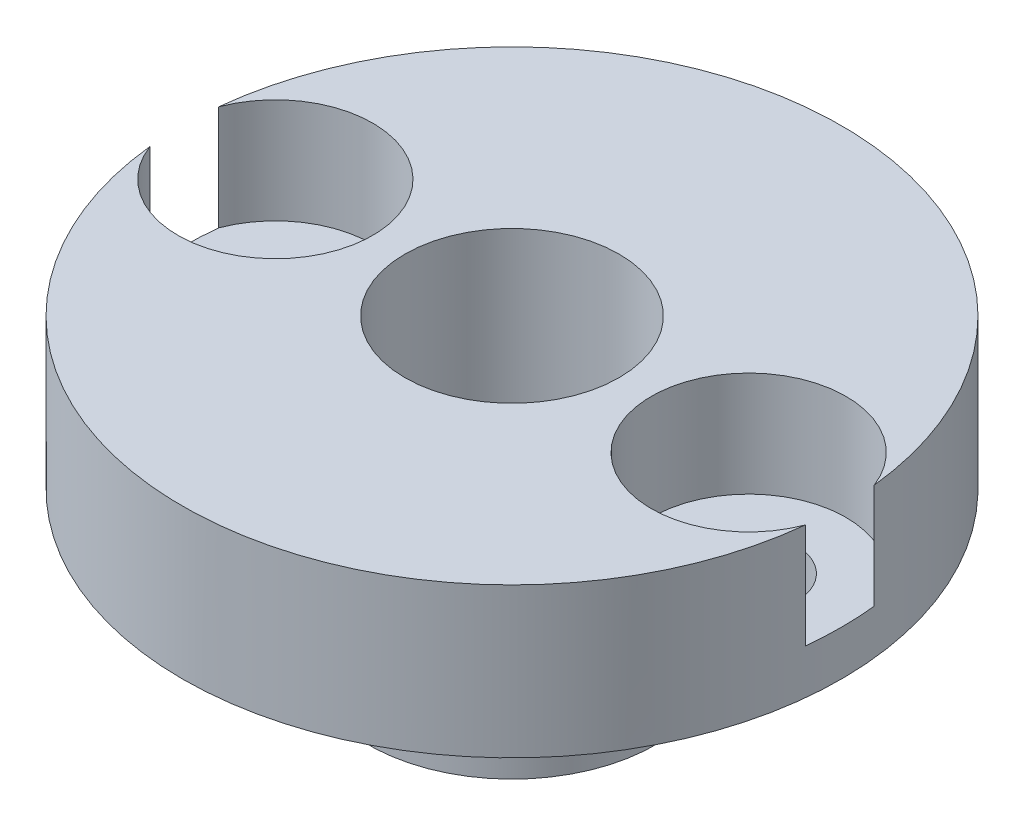
ISO-10303-21;
HEADER;
FILE_DESCRIPTION(('STEP AP214'),'2;1');
FILE_NAME('part.step','',(''),(''),'','','');
FILE_SCHEMA(('AUTOMOTIVE_DESIGN { 1 0 10303 214 1 1 1 1 }'));
ENDSEC;
DATA;
#1=APPLICATION_CONTEXT('core data for automotive mechanical design processes');
#2=APPLICATION_PROTOCOL_DEFINITION('international standard','automotive_design',2000,#1);
#3=PRODUCT_CONTEXT('',#1,'mechanical');
#4=PRODUCT('Part','Part','',(#3));
#5=PRODUCT_RELATED_PRODUCT_CATEGORY('part','',(#4));
#6=PRODUCT_DEFINITION_FORMATION('','',#4);
#7=PRODUCT_DEFINITION_CONTEXT('part definition',#1,'design');
#8=PRODUCT_DEFINITION('design','',#6,#7);
#9=PRODUCT_DEFINITION_SHAPE('','',#8);
#10=(LENGTH_UNIT() NAMED_UNIT(*) SI_UNIT(.MILLI.,.METRE.));
#11=(NAMED_UNIT(*) PLANE_ANGLE_UNIT() SI_UNIT($,.RADIAN.));
#12=(NAMED_UNIT(*) SI_UNIT($,.STERADIAN.) SOLID_ANGLE_UNIT());
#13=UNCERTAINTY_MEASURE_WITH_UNIT(LENGTH_MEASURE(1.E-05),#10,'distance_accuracy_value','');
#14=(GEOMETRIC_REPRESENTATION_CONTEXT(3) GLOBAL_UNCERTAINTY_ASSIGNED_CONTEXT((#13)) GLOBAL_UNIT_ASSIGNED_CONTEXT((#10,
#11,#12)) REPRESENTATION_CONTEXT('',''));
#15=CARTESIAN_POINT('',(0.,0.,0.));
#16=DIRECTION('',(0.,0.,1.));
#17=DIRECTION('',(1.,0.,0.));
#18=AXIS2_PLACEMENT_3D('',#15,#16,#17);
#19=CARTESIAN_POINT('',(7.9,5.,0.));
#20=DIRECTION('',(0.,-1.,0.));
#21=DIRECTION('',(0.,0.,-1.));
#22=AXIS2_PLACEMENT_3D('',#19,#20,#21);
#23=CYLINDRICAL_SURFACE('',#22,1.6);
#24=CARTESIAN_POINT('',(7.9,0.,0.));
#25=DIRECTION('',(0.,-1.,0.));
#26=DIRECTION('',(0.,0.,-1.));
#27=AXIS2_PLACEMENT_3D('',#24,#25,#26);
#28=CIRCLE('',#27,1.6);
#29=CARTESIAN_POINT('',(7.9,0.,-1.6));
#30=VERTEX_POINT('',#29);
#31=EDGE_CURVE('E127',#30,#30,#28,.T.);
#32=ORIENTED_EDGE('',*,*,#31,.T.);
#33=EDGE_LOOP('',(#32));
#34=FACE_BOUND('',#33,.T.);
#35=CARTESIAN_POINT('',(7.9,1.5,0.));
#36=DIRECTION('',(0.,1.,0.));
#37=DIRECTION('',(0.,0.,1.));
#38=AXIS2_PLACEMENT_3D('',#35,#36,#37);
#39=CIRCLE('',#38,1.6);
#40=CARTESIAN_POINT('',(7.9,1.5,1.6));
#41=VERTEX_POINT('',#40);
#42=EDGE_CURVE('E39',#41,#41,#39,.F.);
#43=ORIENTED_EDGE('',*,*,#42,.F.);
#44=EDGE_LOOP('',(#43));
#45=FACE_BOUND('',#44,.T.);
#46=ADVANCED_FACE('F35',(#34,#45),#23,.F.);
#47=CARTESIAN_POINT('',(-7.9,5.,0.));
#48=DIRECTION('',(0.,-1.,0.));
#49=DIRECTION('',(0.,0.,-1.));
#50=AXIS2_PLACEMENT_3D('',#47,#48,#49);
#51=CYLINDRICAL_SURFACE('',#50,1.6);
#52=CARTESIAN_POINT('',(-7.9,0.,0.));
#53=DIRECTION('',(0.,-1.,0.));
#54=DIRECTION('',(0.,0.,-1.));
#55=AXIS2_PLACEMENT_3D('',#52,#53,#54);
#56=CIRCLE('',#55,1.6);
#57=CARTESIAN_POINT('',(-7.9,0.,-1.6));
#58=VERTEX_POINT('',#57);
#59=EDGE_CURVE('E130',#58,#58,#56,.T.);
#60=ORIENTED_EDGE('',*,*,#59,.T.);
#61=EDGE_LOOP('',(#60));
#62=FACE_BOUND('',#61,.T.);
#63=CARTESIAN_POINT('',(-7.9,1.5,0.));
#64=DIRECTION('',(0.,1.,0.));
#65=DIRECTION('',(0.,0.,1.));
#66=AXIS2_PLACEMENT_3D('',#63,#64,#65);
#67=CIRCLE('',#66,1.6);
#68=CARTESIAN_POINT('',(-7.9,1.5,1.6));
#69=VERTEX_POINT('',#68);
#70=EDGE_CURVE('E106',#69,#69,#67,.F.);
#71=ORIENTED_EDGE('',*,*,#70,.F.);
#72=EDGE_LOOP('',(#71));
#73=FACE_BOUND('',#72,.T.);
#74=ADVANCED_FACE('F151',(#62,#73),#51,.F.);
#75=CARTESIAN_POINT('',(0.,5.,0.));
#76=DIRECTION('',(0.,-1.,0.));
#77=DIRECTION('',(0.,0.,-1.));
#78=AXIS2_PLACEMENT_3D('',#75,#76,#77);
#79=CYLINDRICAL_SURFACE('',#78,11.);
#80=CARTESIAN_POINT('',(0.,1.5,0.));
#81=DIRECTION('',(0.,1.,0.));
#82=DIRECTION('',(0.,0.,1.));
#83=AXIS2_PLACEMENT_3D('',#80,#81,#82);
#84=CIRCLE('',#83,11.);
#85=CARTESIAN_POINT('',(-10.9397151898734,1.5,-1.15005720051344));
#86=VERTEX_POINT('',#85);
#87=CARTESIAN_POINT('',(-10.9397151898734,1.5,1.15005720051344));
#88=VERTEX_POINT('',#87);
#89=EDGE_CURVE('E93',#86,#88,#84,.T.);
#90=ORIENTED_EDGE('',*,*,#89,.F.);
#91=DIRECTION('',(0.,1.,0.));
#92=VECTOR('',#91,1.);
#93=CARTESIAN_POINT('',(-10.9397151898734,3.25,-1.15005720051343));
#94=LINE('',#93,#92);
#95=CARTESIAN_POINT('',(-10.9397151898734,5.,-1.15005720051343));
#96=VERTEX_POINT('',#95);
#97=EDGE_CURVE('E80',#86,#96,#94,.T.);
#98=ORIENTED_EDGE('',*,*,#97,.T.);
#99=CARTESIAN_POINT('',(0.,5.,0.));
#100=DIRECTION('',(0.,1.,0.));
#101=DIRECTION('',(0.,0.,1.));
#102=AXIS2_PLACEMENT_3D('',#99,#100,#101);
#103=CIRCLE('',#102,11.);
#104=CARTESIAN_POINT('',(10.9397151898734,5.,-1.15005720051343));
#105=VERTEX_POINT('',#104);
#106=EDGE_CURVE('E44',#105,#96,#103,.T.);
#107=ORIENTED_EDGE('',*,*,#106,.F.);
#108=DIRECTION('',(0.,1.,0.));
#109=VECTOR('',#108,1.);
#110=CARTESIAN_POINT('',(10.9397151898734,3.25,-1.15005720051343));
#111=LINE('',#110,#109);
#112=CARTESIAN_POINT('',(10.9397151898734,1.5,-1.15005720051344));
#113=VERTEX_POINT('',#112);
#114=EDGE_CURVE('E60',#105,#113,#111,.F.);
#115=ORIENTED_EDGE('',*,*,#114,.T.);
#116=CARTESIAN_POINT('',(0.,1.5,0.));
#117=DIRECTION('',(0.,1.,0.));
#118=DIRECTION('',(0.,0.,1.));
#119=AXIS2_PLACEMENT_3D('',#116,#117,#118);
#120=CIRCLE('',#119,11.);
#121=CARTESIAN_POINT('',(10.9397151898734,1.5,1.15005720051344));
#122=VERTEX_POINT('',#121);
#123=EDGE_CURVE('E117',#122,#113,#120,.T.);
#124=ORIENTED_EDGE('',*,*,#123,.F.);
#125=DIRECTION('',(0.,1.,0.));
#126=VECTOR('',#125,1.);
#127=CARTESIAN_POINT('',(10.9397151898734,3.25,1.15005720051343));
#128=LINE('',#127,#126);
#129=CARTESIAN_POINT('',(10.9397151898734,5.,1.15005720051343));
#130=VERTEX_POINT('',#129);
#131=EDGE_CURVE('E120',#122,#130,#128,.T.);
#132=ORIENTED_EDGE('',*,*,#131,.T.);
#133=CARTESIAN_POINT('',(-10.9397151898734,5.,1.15005720051343));
#134=VERTEX_POINT('',#133);
#135=EDGE_CURVE('E99',#134,#130,#103,.T.);
#136=ORIENTED_EDGE('',*,*,#135,.F.);
#137=DIRECTION('',(0.,1.,0.));
#138=VECTOR('',#137,1.);
#139=CARTESIAN_POINT('',(-10.9397151898734,3.25,1.15005720051343));
#140=LINE('',#139,#138);
#141=EDGE_CURVE('E52',#134,#88,#140,.F.);
#142=ORIENTED_EDGE('',*,*,#141,.T.);
#143=EDGE_LOOP('',(#90,#98,#107,#115,#124,#132,#136,#142));
#144=FACE_BOUND('',#143,.T.);
#145=CARTESIAN_POINT('',(0.,0.,0.));
#146=DIRECTION('',(0.,1.,0.));
#147=DIRECTION('',(0.,0.,1.));
#148=AXIS2_PLACEMENT_3D('',#145,#146,#147);
#149=CIRCLE('',#148,11.);
#150=CARTESIAN_POINT('',(0.,0.,11.));
#151=VERTEX_POINT('',#150);
#152=EDGE_CURVE('E101',#151,#151,#149,.T.);
#153=ORIENTED_EDGE('',*,*,#152,.T.);
#154=EDGE_LOOP('',(#153));
#155=FACE_BOUND('',#154,.T.);
#156=ADVANCED_FACE('F37',(#144,#155),#79,.T.);
#157=CARTESIAN_POINT('',(0.,5.,0.));
#158=DIRECTION('',(0.,1.,0.));
#159=DIRECTION('',(0.,0.,1.));
#160=AXIS2_PLACEMENT_3D('',#157,#158,#159);
#161=PLANE('',#160);
#162=CARTESIAN_POINT('',(-7.9,5.,0.));
#163=DIRECTION('',(0.,1.,0.));
#164=DIRECTION('',(0.,0.,1.));
#165=AXIS2_PLACEMENT_3D('',#162,#163,#164);
#166=CIRCLE('',#165,3.25);
#167=EDGE_CURVE('E77',#134,#96,#166,.T.);
#168=ORIENTED_EDGE('',*,*,#167,.F.);
#169=ORIENTED_EDGE('',*,*,#135,.T.);
#170=CARTESIAN_POINT('',(7.9,5.,0.));
#171=DIRECTION('',(0.,1.,0.));
#172=DIRECTION('',(0.,0.,1.));
#173=AXIS2_PLACEMENT_3D('',#170,#171,#172);
#174=CIRCLE('',#173,3.25);
#175=EDGE_CURVE('E98',#105,#130,#174,.T.);
#176=ORIENTED_EDGE('',*,*,#175,.F.);
#177=ORIENTED_EDGE('',*,*,#106,.T.);
#178=EDGE_LOOP('',(#168,#169,#176,#177));
#179=FACE_BOUND('',#178,.T.);
#180=CARTESIAN_POINT('',(0.,5.,0.));
#181=DIRECTION('',(0.,-1.,0.));
#182=DIRECTION('',(0.,0.,-1.));
#183=AXIS2_PLACEMENT_3D('',#180,#181,#182);
#184=CIRCLE('',#183,3.575);
#185=CARTESIAN_POINT('',(0.,5.,-3.575));
#186=VERTEX_POINT('',#185);
#187=EDGE_CURVE('E124',#186,#186,#184,.T.);
#188=ORIENTED_EDGE('',*,*,#187,.T.);
#189=EDGE_LOOP('',(#188));
#190=FACE_BOUND('',#189,.T.);
#191=ADVANCED_FACE('F96',(#179,#190),#161,.T.);
#192=CARTESIAN_POINT('',(0.,0.,0.));
#193=DIRECTION('',(0.,1.,0.));
#194=DIRECTION('',(0.,0.,1.));
#195=AXIS2_PLACEMENT_3D('',#192,#193,#194);
#196=PLANE('',#195);
#197=ORIENTED_EDGE('',*,*,#59,.F.);
#198=EDGE_LOOP('',(#197));
#199=FACE_BOUND('',#198,.T.);
#200=ORIENTED_EDGE('',*,*,#31,.F.);
#201=EDGE_LOOP('',(#200));
#202=FACE_BOUND('',#201,.T.);
#203=CARTESIAN_POINT('',(0.,0.,0.));
#204=DIRECTION('',(0.,-1.,0.));
#205=DIRECTION('',(0.,0.,-1.));
#206=AXIS2_PLACEMENT_3D('',#203,#204,#205);
#207=CIRCLE('',#206,4.8);
#208=CARTESIAN_POINT('',(0.,0.,-4.8));
#209=VERTEX_POINT('',#208);
#210=EDGE_CURVE('E11',#209,#209,#207,.T.);
#211=ORIENTED_EDGE('',*,*,#210,.F.);
#212=EDGE_LOOP('',(#211));
#213=FACE_BOUND('',#212,.T.);
#214=ORIENTED_EDGE('',*,*,#152,.F.);
#215=EDGE_LOOP('',(#214));
#216=FACE_BOUND('',#215,.T.);
#217=ADVANCED_FACE('F142',(#199,#202,#213,#216),#196,.F.);
#218=CARTESIAN_POINT('',(0.,-5.,0.));
#219=DIRECTION('',(0.,1.,0.));
#220=DIRECTION('',(0.,0.,1.));
#221=AXIS2_PLACEMENT_3D('',#218,#219,#220);
#222=CYLINDRICAL_SURFACE('',#221,4.8);
#223=CARTESIAN_POINT('',(0.,-5.,0.));
#224=DIRECTION('',(0.,-1.,0.));
#225=DIRECTION('',(0.,0.,-1.));
#226=AXIS2_PLACEMENT_3D('',#223,#224,#225);
#227=CIRCLE('',#226,4.8);
#228=CARTESIAN_POINT('',(0.,-5.,-4.8));
#229=VERTEX_POINT('',#228);
#230=EDGE_CURVE('E105',#229,#229,#227,.T.);
#231=ORIENTED_EDGE('',*,*,#230,.F.);
#232=EDGE_LOOP('',(#231));
#233=FACE_BOUND('',#232,.T.);
#234=ORIENTED_EDGE('',*,*,#210,.T.);
#235=EDGE_LOOP('',(#234));
#236=FACE_BOUND('',#235,.T.);
#237=ADVANCED_FACE('F139',(#233,#236),#222,.T.);
#238=CARTESIAN_POINT('',(0.,-5.,0.));
#239=DIRECTION('',(0.,-1.,0.));
#240=DIRECTION('',(0.,0.,-1.));
#241=AXIS2_PLACEMENT_3D('',#238,#239,#240);
#242=PLANE('',#241);
#243=CARTESIAN_POINT('',(0.,-5.,0.));
#244=DIRECTION('',(0.,-1.,0.));
#245=DIRECTION('',(0.,0.,-1.));
#246=AXIS2_PLACEMENT_3D('',#243,#244,#245);
#247=CIRCLE('',#246,3.575);
#248=CARTESIAN_POINT('',(0.,-5.,-3.575));
#249=VERTEX_POINT('',#248);
#250=EDGE_CURVE('E94',#249,#249,#247,.T.);
#251=ORIENTED_EDGE('',*,*,#250,.F.);
#252=EDGE_LOOP('',(#251));
#253=FACE_BOUND('',#252,.T.);
#254=ORIENTED_EDGE('',*,*,#230,.T.);
#255=EDGE_LOOP('',(#254));
#256=FACE_BOUND('',#255,.T.);
#257=ADVANCED_FACE('F137',(#253,#256),#242,.T.);
#258=CARTESIAN_POINT('',(0.,5.,0.));
#259=DIRECTION('',(0.,-1.,0.));
#260=DIRECTION('',(0.,0.,-1.));
#261=AXIS2_PLACEMENT_3D('',#258,#259,#260);
#262=CYLINDRICAL_SURFACE('',#261,3.575);
#263=ORIENTED_EDGE('',*,*,#187,.F.);
#264=EDGE_LOOP('',(#263));
#265=FACE_BOUND('',#264,.T.);
#266=ORIENTED_EDGE('',*,*,#250,.T.);
#267=EDGE_LOOP('',(#266));
#268=FACE_BOUND('',#267,.T.);
#269=ADVANCED_FACE('F168',(#265,#268),#262,.F.);
#270=CARTESIAN_POINT('',(-7.9,1.5,0.));
#271=DIRECTION('',(0.,1.,0.));
#272=DIRECTION('',(0.,0.,1.));
#273=AXIS2_PLACEMENT_3D('',#270,#271,#272);
#274=CYLINDRICAL_SURFACE('',#273,3.25);
#275=CARTESIAN_POINT('',(-7.9,1.5,0.));
#276=DIRECTION('',(0.,1.,0.));
#277=DIRECTION('',(0.,0.,1.));
#278=AXIS2_PLACEMENT_3D('',#275,#276,#277);
#279=CIRCLE('',#278,3.25);
#280=EDGE_CURVE('E86',#88,#86,#279,.T.);
#281=ORIENTED_EDGE('',*,*,#280,.F.);
#282=ORIENTED_EDGE('',*,*,#141,.F.);
#283=ORIENTED_EDGE('',*,*,#167,.T.);
#284=ORIENTED_EDGE('',*,*,#97,.F.);
#285=EDGE_LOOP('',(#281,#282,#283,#284));
#286=FACE_BOUND('',#285,.T.);
#287=ADVANCED_FACE('F79',(#286),#274,.F.);
#288=CARTESIAN_POINT('',(-7.9,1.5,0.));
#289=DIRECTION('',(0.,1.,0.));
#290=DIRECTION('',(0.,0.,1.));
#291=AXIS2_PLACEMENT_3D('',#288,#289,#290);
#292=PLANE('',#291);
#293=ORIENTED_EDGE('',*,*,#70,.T.);
#294=EDGE_LOOP('',(#293));
#295=FACE_BOUND('',#294,.T.);
#296=ORIENTED_EDGE('',*,*,#89,.T.);
#297=ORIENTED_EDGE('',*,*,#280,.T.);
#298=EDGE_LOOP('',(#296,#297));
#299=FACE_BOUND('',#298,.T.);
#300=ADVANCED_FACE('F179',(#295,#299),#292,.T.);
#301=CARTESIAN_POINT('',(7.9,1.5,0.));
#302=DIRECTION('',(0.,1.,0.));
#303=DIRECTION('',(0.,0.,1.));
#304=AXIS2_PLACEMENT_3D('',#301,#302,#303);
#305=CYLINDRICAL_SURFACE('',#304,3.25);
#306=CARTESIAN_POINT('',(7.9,1.5,0.));
#307=DIRECTION('',(0.,1.,0.));
#308=DIRECTION('',(0.,0.,1.));
#309=AXIS2_PLACEMENT_3D('',#306,#307,#308);
#310=CIRCLE('',#309,3.25);
#311=EDGE_CURVE('E87',#113,#122,#310,.T.);
#312=ORIENTED_EDGE('',*,*,#311,.F.);
#313=ORIENTED_EDGE('',*,*,#114,.F.);
#314=ORIENTED_EDGE('',*,*,#175,.T.);
#315=ORIENTED_EDGE('',*,*,#131,.F.);
#316=EDGE_LOOP('',(#312,#313,#314,#315));
#317=FACE_BOUND('',#316,.T.);
#318=ADVANCED_FACE('F183',(#317),#305,.F.);
#319=CARTESIAN_POINT('',(7.9,1.5,0.));
#320=DIRECTION('',(0.,1.,0.));
#321=DIRECTION('',(0.,0.,1.));
#322=AXIS2_PLACEMENT_3D('',#319,#320,#321);
#323=PLANE('',#322);
#324=ORIENTED_EDGE('',*,*,#42,.T.);
#325=EDGE_LOOP('',(#324));
#326=FACE_BOUND('',#325,.T.);
#327=ORIENTED_EDGE('',*,*,#123,.T.);
#328=ORIENTED_EDGE('',*,*,#311,.T.);
#329=EDGE_LOOP('',(#327,#328));
#330=FACE_BOUND('',#329,.T.);
#331=ADVANCED_FACE('F186',(#326,#330),#323,.T.);
#332=CLOSED_SHELL('',(#46,#74,#156,#191,#217,#237,#257,#269,#287,#300,#318,#331));
#333=MANIFOLD_SOLID_BREP('B2',#332);
#334=ADVANCED_BREP_SHAPE_REPRESENTATION('',(#18,#333),#14);
#335=SHAPE_DEFINITION_REPRESENTATION(#9,#334);
ENDSEC;
END-ISO-10303-21;
